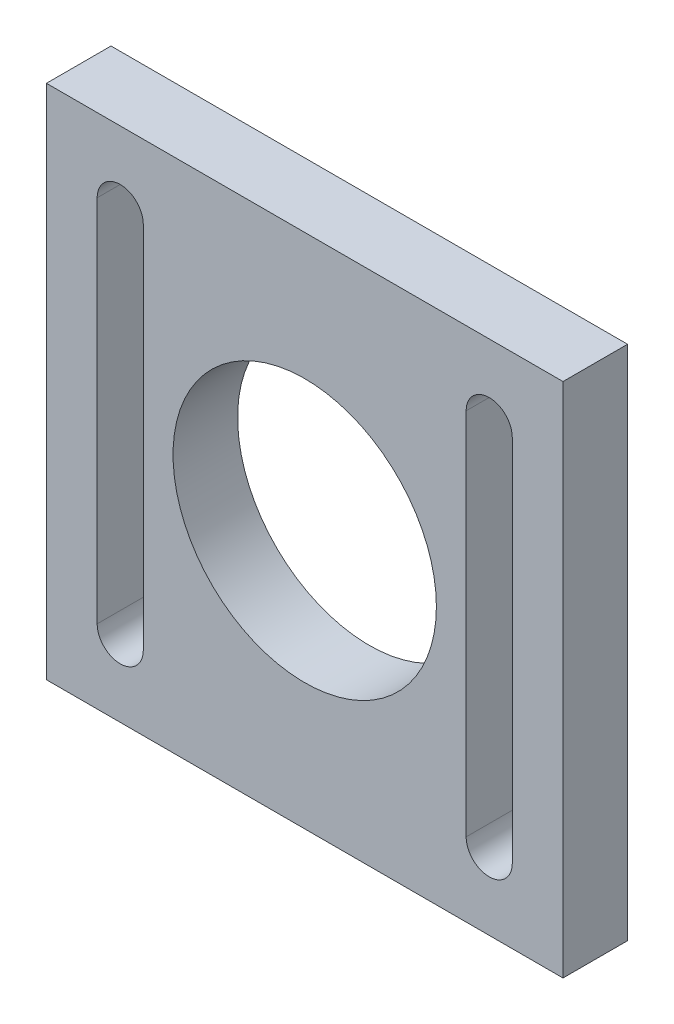
ISO-10303-21;
HEADER;
FILE_DESCRIPTION(('STEP AP214'),'2;1');
FILE_NAME('part.step','',(''),(''),'','','');
FILE_SCHEMA(('AUTOMOTIVE_DESIGN { 1 0 10303 214 1 1 1 1 }'));
ENDSEC;
DATA;
#1=APPLICATION_CONTEXT('core data for automotive mechanical design processes');
#2=APPLICATION_PROTOCOL_DEFINITION('international standard','automotive_design',2000,#1);
#3=PRODUCT_CONTEXT('',#1,'mechanical');
#4=PRODUCT('Part','Part','',(#3));
#5=PRODUCT_RELATED_PRODUCT_CATEGORY('part','',(#4));
#6=PRODUCT_DEFINITION_FORMATION('','',#4);
#7=PRODUCT_DEFINITION_CONTEXT('part definition',#1,'design');
#8=PRODUCT_DEFINITION('design','',#6,#7);
#9=PRODUCT_DEFINITION_SHAPE('','',#8);
#10=(LENGTH_UNIT() NAMED_UNIT(*) SI_UNIT(.MILLI.,.METRE.));
#11=(NAMED_UNIT(*) PLANE_ANGLE_UNIT() SI_UNIT($,.RADIAN.));
#12=(NAMED_UNIT(*) SI_UNIT($,.STERADIAN.) SOLID_ANGLE_UNIT());
#13=UNCERTAINTY_MEASURE_WITH_UNIT(LENGTH_MEASURE(1.E-05),#10,'distance_accuracy_value','');
#14=(GEOMETRIC_REPRESENTATION_CONTEXT(3) GLOBAL_UNCERTAINTY_ASSIGNED_CONTEXT((#13)) GLOBAL_UNIT_ASSIGNED_CONTEXT((#10,
#11,#12)) REPRESENTATION_CONTEXT('',''));
#15=CARTESIAN_POINT('',(0.,0.,0.));
#16=DIRECTION('',(0.,0.,1.));
#17=DIRECTION('',(1.,0.,0.));
#18=AXIS2_PLACEMENT_3D('',#15,#16,#17);
#19=CARTESIAN_POINT('',(0.,0.,7.));
#20=DIRECTION('',(-1.,0.,0.));
#21=DIRECTION('',(0.,0.,1.));
#22=AXIS2_PLACEMENT_3D('',#19,#20,#21);
#23=PLANE('',#22);
#24=DIRECTION('',(0.,1.,0.));
#25=VECTOR('',#24,1.);
#26=CARTESIAN_POINT('',(0.,0.,0.));
#27=LINE('',#26,#25);
#28=CARTESIAN_POINT('',(0.,0.,0.));
#29=VERTEX_POINT('',#28);
#30=CARTESIAN_POINT('',(0.,56.,0.));
#31=VERTEX_POINT('',#30);
#32=EDGE_CURVE('E196',#29,#31,#27,.T.);
#33=ORIENTED_EDGE('',*,*,#32,.F.);
#34=DIRECTION('',(0.,0.,-1.));
#35=VECTOR('',#34,1.);
#36=CARTESIAN_POINT('',(0.,0.,7.));
#37=LINE('',#36,#35);
#38=CARTESIAN_POINT('',(0.,0.,7.));
#39=VERTEX_POINT('',#38);
#40=EDGE_CURVE('E11',#39,#29,#37,.T.);
#41=ORIENTED_EDGE('',*,*,#40,.F.);
#42=DIRECTION('',(0.,1.,0.));
#43=VECTOR('',#42,1.);
#44=CARTESIAN_POINT('',(0.,0.,7.));
#45=LINE('',#44,#43);
#46=CARTESIAN_POINT('',(0.,56.,7.));
#47=VERTEX_POINT('',#46);
#48=EDGE_CURVE('E199',#39,#47,#45,.T.);
#49=ORIENTED_EDGE('',*,*,#48,.T.);
#50=DIRECTION('',(0.,0.,-1.));
#51=VECTOR('',#50,1.);
#52=CARTESIAN_POINT('',(0.,56.,7.));
#53=LINE('',#52,#51);
#54=EDGE_CURVE('E45',#47,#31,#53,.T.);
#55=ORIENTED_EDGE('',*,*,#54,.T.);
#56=EDGE_LOOP('',(#33,#41,#49,#55));
#57=FACE_BOUND('',#56,.T.);
#58=ADVANCED_FACE('F39',(#57),#23,.T.);
#59=CARTESIAN_POINT('',(0.,0.,7.));
#60=DIRECTION('',(0.,1.,0.));
#61=DIRECTION('',(0.,0.,1.));
#62=AXIS2_PLACEMENT_3D('',#59,#60,#61);
#63=PLANE('',#62);
#64=DIRECTION('',(1.,0.,0.));
#65=VECTOR('',#64,1.);
#66=CARTESIAN_POINT('',(0.,0.,0.));
#67=LINE('',#66,#65);
#68=CARTESIAN_POINT('',(56.,0.,0.));
#69=VERTEX_POINT('',#68);
#70=EDGE_CURVE('E204',#29,#69,#67,.T.);
#71=ORIENTED_EDGE('',*,*,#70,.T.);
#72=DIRECTION('',(0.,0.,-1.));
#73=VECTOR('',#72,1.);
#74=CARTESIAN_POINT('',(56.,0.,7.));
#75=LINE('',#74,#73);
#76=CARTESIAN_POINT('',(56.,0.,7.));
#77=VERTEX_POINT('',#76);
#78=EDGE_CURVE('E50',#77,#69,#75,.T.);
#79=ORIENTED_EDGE('',*,*,#78,.F.);
#80=DIRECTION('',(1.,0.,0.));
#81=VECTOR('',#80,1.);
#82=CARTESIAN_POINT('',(0.,0.,7.));
#83=LINE('',#82,#81);
#84=EDGE_CURVE('E207',#39,#77,#83,.T.);
#85=ORIENTED_EDGE('',*,*,#84,.F.);
#86=ORIENTED_EDGE('',*,*,#40,.T.);
#87=EDGE_LOOP('',(#71,#79,#85,#86));
#88=FACE_BOUND('',#87,.T.);
#89=ADVANCED_FACE('F237',(#88),#63,.F.);
#90=CARTESIAN_POINT('',(56.,0.,7.));
#91=DIRECTION('',(-1.,0.,0.));
#92=DIRECTION('',(0.,0.,1.));
#93=AXIS2_PLACEMENT_3D('',#90,#91,#92);
#94=PLANE('',#93);
#95=DIRECTION('',(0.,1.,0.));
#96=VECTOR('',#95,1.);
#97=CARTESIAN_POINT('',(56.,0.,0.));
#98=LINE('',#97,#96);
#99=CARTESIAN_POINT('',(56.,56.,0.));
#100=VERTEX_POINT('',#99);
#101=EDGE_CURVE('E216',#69,#100,#98,.T.);
#102=ORIENTED_EDGE('',*,*,#101,.T.);
#103=DIRECTION('',(0.,0.,-1.));
#104=VECTOR('',#103,1.);
#105=CARTESIAN_POINT('',(56.,56.,7.));
#106=LINE('',#105,#104);
#107=CARTESIAN_POINT('',(56.,56.,7.));
#108=VERTEX_POINT('',#107);
#109=EDGE_CURVE('E222',#108,#100,#106,.T.);
#110=ORIENTED_EDGE('',*,*,#109,.F.);
#111=DIRECTION('',(0.,1.,0.));
#112=VECTOR('',#111,1.);
#113=CARTESIAN_POINT('',(56.,0.,7.));
#114=LINE('',#113,#112);
#115=EDGE_CURVE('E210',#77,#108,#114,.T.);
#116=ORIENTED_EDGE('',*,*,#115,.F.);
#117=ORIENTED_EDGE('',*,*,#78,.T.);
#118=EDGE_LOOP('',(#102,#110,#116,#117));
#119=FACE_BOUND('',#118,.T.);
#120=ADVANCED_FACE('F238',(#119),#94,.F.);
#121=CARTESIAN_POINT('',(0.,56.,7.));
#122=DIRECTION('',(0.,1.,0.));
#123=DIRECTION('',(0.,0.,1.));
#124=AXIS2_PLACEMENT_3D('',#121,#122,#123);
#125=PLANE('',#124);
#126=DIRECTION('',(1.,0.,0.));
#127=VECTOR('',#126,1.);
#128=CARTESIAN_POINT('',(0.,56.,0.));
#129=LINE('',#128,#127);
#130=EDGE_CURVE('E213',#31,#100,#129,.T.);
#131=ORIENTED_EDGE('',*,*,#130,.F.);
#132=ORIENTED_EDGE('',*,*,#54,.F.);
#133=DIRECTION('',(1.,0.,0.));
#134=VECTOR('',#133,1.);
#135=CARTESIAN_POINT('',(0.,56.,7.));
#136=LINE('',#135,#134);
#137=EDGE_CURVE('E201',#47,#108,#136,.T.);
#138=ORIENTED_EDGE('',*,*,#137,.T.);
#139=ORIENTED_EDGE('',*,*,#109,.T.);
#140=EDGE_LOOP('',(#131,#132,#138,#139));
#141=FACE_BOUND('',#140,.T.);
#142=ADVANCED_FACE('F227',(#141),#125,.T.);
#143=CARTESIAN_POINT('',(0.,0.,7.));
#144=DIRECTION('',(0.,0.,-1.));
#145=DIRECTION('',(-1.,0.,0.));
#146=AXIS2_PLACEMENT_3D('',#143,#144,#145);
#147=PLANE('',#146);
#148=DIRECTION('',(0.,-1.,0.));
#149=VECTOR('',#148,1.);
#150=CARTESIAN_POINT('',(45.5,48.,7.));
#151=LINE('',#150,#149);
#152=CARTESIAN_POINT('',(45.5,48.,7.));
#153=VERTEX_POINT('',#152);
#154=CARTESIAN_POINT('',(45.5,8.,7.));
#155=VERTEX_POINT('',#154);
#156=EDGE_CURVE('E181',#153,#155,#151,.T.);
#157=ORIENTED_EDGE('',*,*,#156,.F.);
#158=CARTESIAN_POINT('',(48.,48.,7.));
#159=DIRECTION('',(0.,0.,1.));
#160=DIRECTION('',(1.,0.,0.));
#161=AXIS2_PLACEMENT_3D('',#158,#159,#160);
#162=CIRCLE('',#161,2.50000000000001);
#163=CARTESIAN_POINT('',(50.5,48.,7.));
#164=VERTEX_POINT('',#163);
#165=EDGE_CURVE('E54',#164,#153,#162,.T.);
#166=ORIENTED_EDGE('',*,*,#165,.F.);
#167=DIRECTION('',(0.,1.,0.));
#168=VECTOR('',#167,1.);
#169=CARTESIAN_POINT('',(50.5,48.,7.));
#170=LINE('',#169,#168);
#171=CARTESIAN_POINT('',(50.5,8.,7.));
#172=VERTEX_POINT('',#171);
#173=EDGE_CURVE('E179',#172,#164,#170,.T.);
#174=ORIENTED_EDGE('',*,*,#173,.F.);
#175=CARTESIAN_POINT('',(48.,8.,7.));
#176=DIRECTION('',(0.,0.,1.));
#177=DIRECTION('',(1.,0.,0.));
#178=AXIS2_PLACEMENT_3D('',#175,#176,#177);
#179=CIRCLE('',#178,2.50000000000001);
#180=EDGE_CURVE('E178',#155,#172,#179,.T.);
#181=ORIENTED_EDGE('',*,*,#180,.F.);
#182=EDGE_LOOP('',(#157,#166,#174,#181));
#183=FACE_BOUND('',#182,.T.);
#184=DIRECTION('',(0.,-1.,0.));
#185=VECTOR('',#184,1.);
#186=CARTESIAN_POINT('',(5.5,48.,7.));
#187=LINE('',#186,#185);
#188=CARTESIAN_POINT('',(5.5,48.,7.));
#189=VERTEX_POINT('',#188);
#190=CARTESIAN_POINT('',(5.5,8.,7.));
#191=VERTEX_POINT('',#190);
#192=EDGE_CURVE('E146',#189,#191,#187,.T.);
#193=ORIENTED_EDGE('',*,*,#192,.F.);
#194=CARTESIAN_POINT('',(8.,48.,7.));
#195=DIRECTION('',(0.,0.,1.));
#196=DIRECTION('',(1.,0.,0.));
#197=AXIS2_PLACEMENT_3D('',#194,#195,#196);
#198=CIRCLE('',#197,2.5);
#199=CARTESIAN_POINT('',(10.5,48.,7.));
#200=VERTEX_POINT('',#199);
#201=EDGE_CURVE('E61',#200,#189,#198,.T.);
#202=ORIENTED_EDGE('',*,*,#201,.F.);
#203=DIRECTION('',(0.,1.,0.));
#204=VECTOR('',#203,1.);
#205=CARTESIAN_POINT('',(10.5,48.,7.));
#206=LINE('',#205,#204);
#207=CARTESIAN_POINT('',(10.5,8.,7.));
#208=VERTEX_POINT('',#207);
#209=EDGE_CURVE('E136',#208,#200,#206,.T.);
#210=ORIENTED_EDGE('',*,*,#209,.F.);
#211=CARTESIAN_POINT('',(8.,8.,7.));
#212=DIRECTION('',(0.,0.,1.));
#213=DIRECTION('',(1.,0.,0.));
#214=AXIS2_PLACEMENT_3D('',#211,#212,#213);
#215=CIRCLE('',#214,2.5);
#216=EDGE_CURVE('E142',#191,#208,#215,.T.);
#217=ORIENTED_EDGE('',*,*,#216,.F.);
#218=EDGE_LOOP('',(#193,#202,#210,#217));
#219=FACE_BOUND('',#218,.T.);
#220=CARTESIAN_POINT('',(28.,28.,7.));
#221=DIRECTION('',(0.,0.,1.));
#222=DIRECTION('',(1.,0.,0.));
#223=AXIS2_PLACEMENT_3D('',#220,#221,#222);
#224=CIRCLE('',#223,14.275);
#225=CARTESIAN_POINT('',(42.275,28.,7.));
#226=VERTEX_POINT('',#225);
#227=EDGE_CURVE('E149',#226,#226,#224,.T.);
#228=ORIENTED_EDGE('',*,*,#227,.F.);
#229=EDGE_LOOP('',(#228));
#230=FACE_BOUND('',#229,.T.);
#231=ORIENTED_EDGE('',*,*,#48,.F.);
#232=ORIENTED_EDGE('',*,*,#84,.T.);
#233=ORIENTED_EDGE('',*,*,#115,.T.);
#234=ORIENTED_EDGE('',*,*,#137,.F.);
#235=EDGE_LOOP('',(#231,#232,#233,#234));
#236=FACE_BOUND('',#235,.T.);
#237=ADVANCED_FACE('F144',(#183,#219,#230,#236),#147,.F.);
#238=CARTESIAN_POINT('',(0.,0.,0.));
#239=DIRECTION('',(0.,0.,-1.));
#240=DIRECTION('',(-1.,0.,0.));
#241=AXIS2_PLACEMENT_3D('',#238,#239,#240);
#242=PLANE('',#241);
#243=CARTESIAN_POINT('',(48.,48.,0.));
#244=DIRECTION('',(0.,0.,1.));
#245=DIRECTION('',(1.,0.,0.));
#246=AXIS2_PLACEMENT_3D('',#243,#244,#245);
#247=CIRCLE('',#246,2.50000000000001);
#248=CARTESIAN_POINT('',(50.5,48.,0.));
#249=VERTEX_POINT('',#248);
#250=CARTESIAN_POINT('',(45.5,48.,0.));
#251=VERTEX_POINT('',#250);
#252=EDGE_CURVE('E177',#249,#251,#247,.T.);
#253=ORIENTED_EDGE('',*,*,#252,.T.);
#254=DIRECTION('',(0.,-1.,0.));
#255=VECTOR('',#254,1.);
#256=CARTESIAN_POINT('',(45.5,48.,0.));
#257=LINE('',#256,#255);
#258=CARTESIAN_POINT('',(45.5,8.,0.));
#259=VERTEX_POINT('',#258);
#260=EDGE_CURVE('E191',#251,#259,#257,.T.);
#261=ORIENTED_EDGE('',*,*,#260,.T.);
#262=CARTESIAN_POINT('',(48.,8.,0.));
#263=DIRECTION('',(0.,0.,1.));
#264=DIRECTION('',(1.,0.,0.));
#265=AXIS2_PLACEMENT_3D('',#262,#263,#264);
#266=CIRCLE('',#265,2.50000000000001);
#267=CARTESIAN_POINT('',(50.5,8.,0.));
#268=VERTEX_POINT('',#267);
#269=EDGE_CURVE('E187',#259,#268,#266,.T.);
#270=ORIENTED_EDGE('',*,*,#269,.T.);
#271=DIRECTION('',(0.,1.,0.));
#272=VECTOR('',#271,1.);
#273=CARTESIAN_POINT('',(50.5,48.,0.));
#274=LINE('',#273,#272);
#275=EDGE_CURVE('E166',#268,#249,#274,.T.);
#276=ORIENTED_EDGE('',*,*,#275,.T.);
#277=EDGE_LOOP('',(#253,#261,#270,#276));
#278=FACE_BOUND('',#277,.T.);
#279=CARTESIAN_POINT('',(8.,48.,0.));
#280=DIRECTION('',(0.,0.,1.));
#281=DIRECTION('',(1.,0.,0.));
#282=AXIS2_PLACEMENT_3D('',#279,#280,#281);
#283=CIRCLE('',#282,2.5);
#284=CARTESIAN_POINT('',(10.5,48.,0.));
#285=VERTEX_POINT('',#284);
#286=CARTESIAN_POINT('',(5.5,48.,0.));
#287=VERTEX_POINT('',#286);
#288=EDGE_CURVE('E128',#285,#287,#283,.T.);
#289=ORIENTED_EDGE('',*,*,#288,.T.);
#290=DIRECTION('',(0.,-1.,0.));
#291=VECTOR('',#290,1.);
#292=CARTESIAN_POINT('',(5.5,48.,0.));
#293=LINE('',#292,#291);
#294=CARTESIAN_POINT('',(5.5,8.,0.));
#295=VERTEX_POINT('',#294);
#296=EDGE_CURVE('E162',#287,#295,#293,.T.);
#297=ORIENTED_EDGE('',*,*,#296,.T.);
#298=CARTESIAN_POINT('',(8.,8.,0.));
#299=DIRECTION('',(0.,0.,1.));
#300=DIRECTION('',(1.,0.,0.));
#301=AXIS2_PLACEMENT_3D('',#298,#299,#300);
#302=CIRCLE('',#301,2.5);
#303=CARTESIAN_POINT('',(10.5,8.,0.));
#304=VERTEX_POINT('',#303);
#305=EDGE_CURVE('E157',#295,#304,#302,.T.);
#306=ORIENTED_EDGE('',*,*,#305,.T.);
#307=DIRECTION('',(0.,1.,0.));
#308=VECTOR('',#307,1.);
#309=CARTESIAN_POINT('',(10.5,48.,0.));
#310=LINE('',#309,#308);
#311=EDGE_CURVE('E160',#304,#285,#310,.T.);
#312=ORIENTED_EDGE('',*,*,#311,.T.);
#313=EDGE_LOOP('',(#289,#297,#306,#312));
#314=FACE_BOUND('',#313,.T.);
#315=CARTESIAN_POINT('',(28.,28.,0.));
#316=DIRECTION('',(0.,0.,1.));
#317=DIRECTION('',(1.,0.,0.));
#318=AXIS2_PLACEMENT_3D('',#315,#316,#317);
#319=CIRCLE('',#318,14.275);
#320=CARTESIAN_POINT('',(42.275,28.,0.));
#321=VERTEX_POINT('',#320);
#322=EDGE_CURVE('E155',#321,#321,#319,.T.);
#323=ORIENTED_EDGE('',*,*,#322,.T.);
#324=EDGE_LOOP('',(#323));
#325=FACE_BOUND('',#324,.T.);
#326=ORIENTED_EDGE('',*,*,#32,.T.);
#327=ORIENTED_EDGE('',*,*,#130,.T.);
#328=ORIENTED_EDGE('',*,*,#101,.F.);
#329=ORIENTED_EDGE('',*,*,#70,.F.);
#330=EDGE_LOOP('',(#326,#327,#328,#329));
#331=FACE_BOUND('',#330,.T.);
#332=ADVANCED_FACE('F235',(#278,#314,#325,#331),#242,.T.);
#333=CARTESIAN_POINT('',(28.,28.,0.));
#334=DIRECTION('',(0.,0.,1.));
#335=DIRECTION('',(1.,0.,0.));
#336=AXIS2_PLACEMENT_3D('',#333,#334,#335);
#337=CYLINDRICAL_SURFACE('',#336,14.275);
#338=ORIENTED_EDGE('',*,*,#322,.F.);
#339=EDGE_LOOP('',(#338));
#340=FACE_BOUND('',#339,.T.);
#341=ORIENTED_EDGE('',*,*,#227,.T.);
#342=EDGE_LOOP('',(#341));
#343=FACE_BOUND('',#342,.T.);
#344=ADVANCED_FACE('F248',(#340,#343),#337,.F.);
#345=CARTESIAN_POINT('',(8.,48.,0.));
#346=DIRECTION('',(0.,0.,1.));
#347=DIRECTION('',(1.,0.,0.));
#348=AXIS2_PLACEMENT_3D('',#345,#346,#347);
#349=CYLINDRICAL_SURFACE('',#348,2.5);
#350=ORIENTED_EDGE('',*,*,#201,.T.);
#351=DIRECTION('',(0.,0.,1.));
#352=VECTOR('',#351,1.);
#353=CARTESIAN_POINT('',(5.5,48.,0.));
#354=LINE('',#353,#352);
#355=EDGE_CURVE('E159',#287,#189,#354,.T.);
#356=ORIENTED_EDGE('',*,*,#355,.F.);
#357=ORIENTED_EDGE('',*,*,#288,.F.);
#358=DIRECTION('',(0.,0.,1.));
#359=VECTOR('',#358,1.);
#360=CARTESIAN_POINT('',(10.5,48.,0.));
#361=LINE('',#360,#359);
#362=EDGE_CURVE('E127',#285,#200,#361,.T.);
#363=ORIENTED_EDGE('',*,*,#362,.T.);
#364=EDGE_LOOP('',(#350,#356,#357,#363));
#365=FACE_BOUND('',#364,.T.);
#366=ADVANCED_FACE('F126',(#365),#349,.F.);
#367=CARTESIAN_POINT('',(10.5,48.,0.));
#368=DIRECTION('',(1.,0.,0.));
#369=DIRECTION('',(0.,1.,0.));
#370=AXIS2_PLACEMENT_3D('',#367,#368,#369);
#371=PLANE('',#370);
#372=ORIENTED_EDGE('',*,*,#209,.T.);
#373=ORIENTED_EDGE('',*,*,#362,.F.);
#374=ORIENTED_EDGE('',*,*,#311,.F.);
#375=DIRECTION('',(0.,0.,1.));
#376=VECTOR('',#375,1.);
#377=CARTESIAN_POINT('',(10.5,8.,0.));
#378=LINE('',#377,#376);
#379=EDGE_CURVE('E132',#304,#208,#378,.T.);
#380=ORIENTED_EDGE('',*,*,#379,.T.);
#381=EDGE_LOOP('',(#372,#373,#374,#380));
#382=FACE_BOUND('',#381,.T.);
#383=ADVANCED_FACE('F140',(#382),#371,.F.);
#384=CARTESIAN_POINT('',(8.,8.,0.));
#385=DIRECTION('',(0.,0.,1.));
#386=DIRECTION('',(1.,0.,0.));
#387=AXIS2_PLACEMENT_3D('',#384,#385,#386);
#388=CYLINDRICAL_SURFACE('',#387,2.5);
#389=ORIENTED_EDGE('',*,*,#216,.T.);
#390=ORIENTED_EDGE('',*,*,#379,.F.);
#391=ORIENTED_EDGE('',*,*,#305,.F.);
#392=DIRECTION('',(0.,0.,1.));
#393=VECTOR('',#392,1.);
#394=CARTESIAN_POINT('',(5.5,8.,0.));
#395=LINE('',#394,#393);
#396=EDGE_CURVE('E379',#295,#191,#395,.T.);
#397=ORIENTED_EDGE('',*,*,#396,.T.);
#398=EDGE_LOOP('',(#389,#390,#391,#397));
#399=FACE_BOUND('',#398,.T.);
#400=ADVANCED_FACE('F308',(#399),#388,.F.);
#401=CARTESIAN_POINT('',(5.5,48.,0.));
#402=DIRECTION('',(-1.,0.,0.));
#403=DIRECTION('',(0.,-1.,0.));
#404=AXIS2_PLACEMENT_3D('',#401,#402,#403);
#405=PLANE('',#404);
#406=ORIENTED_EDGE('',*,*,#192,.T.);
#407=ORIENTED_EDGE('',*,*,#396,.F.);
#408=ORIENTED_EDGE('',*,*,#296,.F.);
#409=ORIENTED_EDGE('',*,*,#355,.T.);
#410=EDGE_LOOP('',(#406,#407,#408,#409));
#411=FACE_BOUND('',#410,.T.);
#412=ADVANCED_FACE('F312',(#411),#405,.F.);
#413=CARTESIAN_POINT('',(48.,48.,0.));
#414=DIRECTION('',(0.,0.,1.));
#415=DIRECTION('',(1.,0.,0.));
#416=AXIS2_PLACEMENT_3D('',#413,#414,#415);
#417=CYLINDRICAL_SURFACE('',#416,2.50000000000001);
#418=ORIENTED_EDGE('',*,*,#165,.T.);
#419=DIRECTION('',(0.,0.,1.));
#420=VECTOR('',#419,1.);
#421=CARTESIAN_POINT('',(45.5,48.,0.));
#422=LINE('',#421,#420);
#423=EDGE_CURVE('E170',#251,#153,#422,.T.);
#424=ORIENTED_EDGE('',*,*,#423,.F.);
#425=ORIENTED_EDGE('',*,*,#252,.F.);
#426=DIRECTION('',(0.,0.,1.));
#427=VECTOR('',#426,1.);
#428=CARTESIAN_POINT('',(50.5,48.,0.));
#429=LINE('',#428,#427);
#430=EDGE_CURVE('E172',#249,#164,#429,.T.);
#431=ORIENTED_EDGE('',*,*,#430,.T.);
#432=EDGE_LOOP('',(#418,#424,#425,#431));
#433=FACE_BOUND('',#432,.T.);
#434=ADVANCED_FACE('F324',(#433),#417,.F.);
#435=CARTESIAN_POINT('',(50.5,48.,0.));
#436=DIRECTION('',(1.,0.,0.));
#437=DIRECTION('',(0.,0.,-1.));
#438=AXIS2_PLACEMENT_3D('',#435,#436,#437);
#439=PLANE('',#438);
#440=ORIENTED_EDGE('',*,*,#173,.T.);
#441=ORIENTED_EDGE('',*,*,#430,.F.);
#442=ORIENTED_EDGE('',*,*,#275,.F.);
#443=DIRECTION('',(0.,0.,1.));
#444=VECTOR('',#443,1.);
#445=CARTESIAN_POINT('',(50.5,8.,0.));
#446=LINE('',#445,#444);
#447=EDGE_CURVE('E175',#268,#172,#446,.T.);
#448=ORIENTED_EDGE('',*,*,#447,.T.);
#449=EDGE_LOOP('',(#440,#441,#442,#448));
#450=FACE_BOUND('',#449,.T.);
#451=ADVANCED_FACE('F333',(#450),#439,.F.);
#452=CARTESIAN_POINT('',(48.,8.,0.));
#453=DIRECTION('',(0.,0.,1.));
#454=DIRECTION('',(1.,0.,0.));
#455=AXIS2_PLACEMENT_3D('',#452,#453,#454);
#456=CYLINDRICAL_SURFACE('',#455,2.50000000000001);
#457=ORIENTED_EDGE('',*,*,#180,.T.);
#458=ORIENTED_EDGE('',*,*,#447,.F.);
#459=ORIENTED_EDGE('',*,*,#269,.F.);
#460=DIRECTION('',(0.,0.,1.));
#461=VECTOR('',#460,1.);
#462=CARTESIAN_POINT('',(45.5,8.,0.));
#463=LINE('',#462,#461);
#464=EDGE_CURVE('E168',#259,#155,#463,.T.);
#465=ORIENTED_EDGE('',*,*,#464,.T.);
#466=EDGE_LOOP('',(#457,#458,#459,#465));
#467=FACE_BOUND('',#466,.T.);
#468=ADVANCED_FACE('F343',(#467),#456,.F.);
#469=CARTESIAN_POINT('',(45.5,48.,0.));
#470=DIRECTION('',(-1.,0.,0.));
#471=DIRECTION('',(0.,0.,1.));
#472=AXIS2_PLACEMENT_3D('',#469,#470,#471);
#473=PLANE('',#472);
#474=ORIENTED_EDGE('',*,*,#156,.T.);
#475=ORIENTED_EDGE('',*,*,#464,.F.);
#476=ORIENTED_EDGE('',*,*,#260,.F.);
#477=ORIENTED_EDGE('',*,*,#423,.T.);
#478=EDGE_LOOP('',(#474,#475,#476,#477));
#479=FACE_BOUND('',#478,.T.);
#480=ADVANCED_FACE('F352',(#479),#473,.F.);
#481=CLOSED_SHELL('',(#58,#89,#120,#142,#237,#332,#344,#366,#383,#400,#412,#434,#451,#468,#480));
#482=MANIFOLD_SOLID_BREP('B2',#481);
#483=ADVANCED_BREP_SHAPE_REPRESENTATION('',(#18,#482),#14);
#484=SHAPE_DEFINITION_REPRESENTATION(#9,#483);
ENDSEC;
END-ISO-10303-21;
